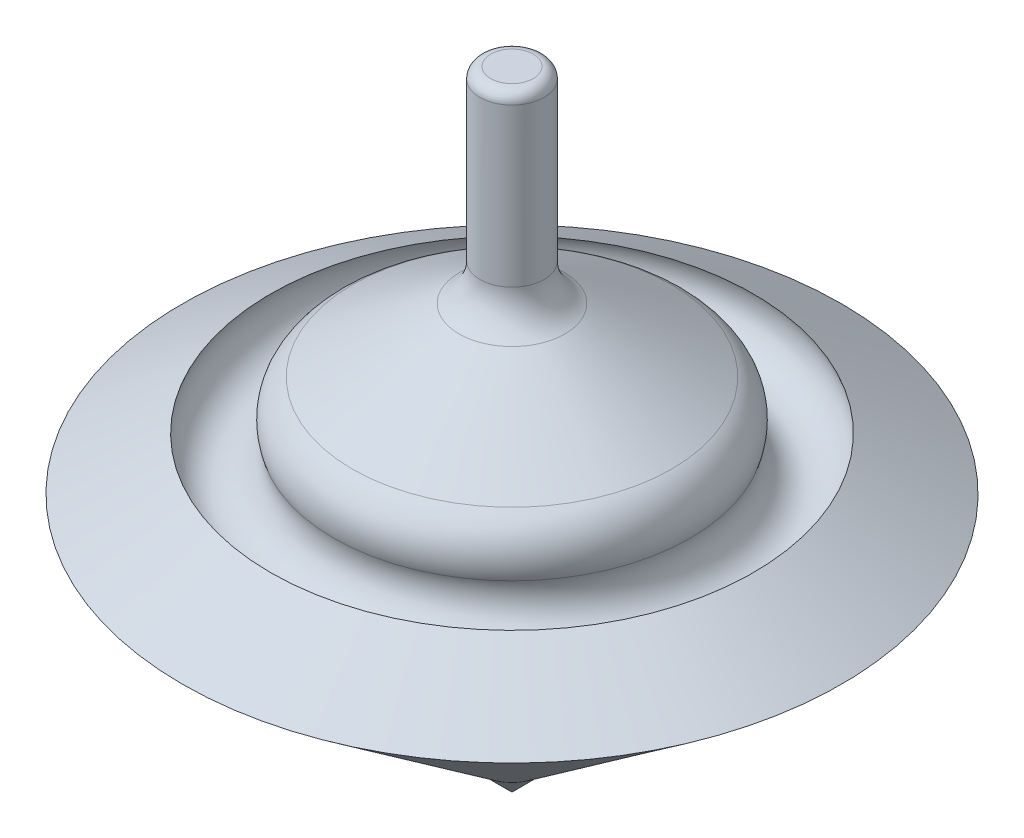
ISO-10303-21;
HEADER;
FILE_DESCRIPTION(('STEP AP214'),'2;1');
FILE_NAME('part.step','',(''),(''),'','','');
FILE_SCHEMA(('AUTOMOTIVE_DESIGN { 1 0 10303 214 1 1 1 1 }'));
ENDSEC;
DATA;
#1=APPLICATION_CONTEXT('core data for automotive mechanical design processes');
#2=APPLICATION_PROTOCOL_DEFINITION('international standard','automotive_design',2000,#1);
#3=PRODUCT_CONTEXT('',#1,'mechanical');
#4=PRODUCT('Part','Part','',(#3));
#5=PRODUCT_RELATED_PRODUCT_CATEGORY('part','',(#4));
#6=PRODUCT_DEFINITION_FORMATION('','',#4);
#7=PRODUCT_DEFINITION_CONTEXT('part definition',#1,'design');
#8=PRODUCT_DEFINITION('design','',#6,#7);
#9=PRODUCT_DEFINITION_SHAPE('','',#8);
#10=(LENGTH_UNIT() NAMED_UNIT(*) SI_UNIT(.MILLI.,.METRE.));
#11=(NAMED_UNIT(*) PLANE_ANGLE_UNIT() SI_UNIT($,.RADIAN.));
#12=(NAMED_UNIT(*) SI_UNIT($,.STERADIAN.) SOLID_ANGLE_UNIT());
#13=UNCERTAINTY_MEASURE_WITH_UNIT(LENGTH_MEASURE(1.E-05),#10,'distance_accuracy_value','');
#14=(GEOMETRIC_REPRESENTATION_CONTEXT(3) GLOBAL_UNCERTAINTY_ASSIGNED_CONTEXT((#13)) GLOBAL_UNIT_ASSIGNED_CONTEXT((#10,
#11,#12)) REPRESENTATION_CONTEXT('',''));
#15=CARTESIAN_POINT('',(0.,0.,0.));
#16=DIRECTION('',(0.,0.,1.));
#17=DIRECTION('',(1.,0.,0.));
#18=AXIS2_PLACEMENT_3D('',#15,#16,#17);
#19=CARTESIAN_POINT('',(0.,-33.3718770924988,0.28991346787051));
#20=DIRECTION('',(0.,-1.,0.));
#21=DIRECTION('',(0.,0.,-1.));
#22=AXIS2_PLACEMENT_3D('',#19,#20,#21);
#23=PLANE('',#22);
#24=CARTESIAN_POINT('',(0.,-33.3718770924988,0.));
#25=DIRECTION('',(0.,-1.,0.));
#26=DIRECTION('',(0.,0.,-1.));
#27=AXIS2_PLACEMENT_3D('',#24,#25,#26);
#28=CIRCLE('',#27,6.56409415873888);
#29=CARTESIAN_POINT('',(0.,-33.3718770924988,-6.56409415873888));
#30=VERTEX_POINT('',#29);
#31=EDGE_CURVE('E55',#30,#30,#28,.T.);
#32=ORIENTED_EDGE('',*,*,#31,.F.);
#33=EDGE_LOOP('',(#32));
#34=FACE_BOUND('',#33,.T.);
#35=CARTESIAN_POINT('',(0.,-33.3718770924988,0.));
#36=DIRECTION('',(0.,-1.,0.));
#37=DIRECTION('',(0.,0.,-1.));
#38=AXIS2_PLACEMENT_3D('',#35,#36,#37);
#39=CIRCLE('',#38,0.28991346787051);
#40=CARTESIAN_POINT('',(0.,-33.3718770924988,-0.28991346787051));
#41=VERTEX_POINT('',#40);
#42=EDGE_CURVE('E11',#41,#41,#39,.T.);
#43=ORIENTED_EDGE('',*,*,#42,.T.);
#44=EDGE_LOOP('',(#43));
#45=FACE_BOUND('',#44,.T.);
#46=ADVANCED_FACE('F45',(#34,#45),#23,.F.);
#47=CARTESIAN_POINT('',(0.,-49.303627638969,0.));
#48=DIRECTION('',(0.,-1.,0.));
#49=DIRECTION('',(0.,0.,-1.));
#50=AXIS2_PLACEMENT_3D('',#47,#48,#49);
#51=CYLINDRICAL_SURFACE('',#50,0.28991346787051);
#52=ORIENTED_EDGE('',*,*,#42,.F.);
#53=EDGE_LOOP('',(#52));
#54=FACE_BOUND('',#53,.T.);
#55=CARTESIAN_POINT('',(0.,-39.646057783367,0.));
#56=DIRECTION('',(0.,-1.,0.));
#57=DIRECTION('',(0.,0.,-1.));
#58=AXIS2_PLACEMENT_3D('',#55,#56,#57);
#59=CIRCLE('',#58,0.28991346787051);
#60=CARTESIAN_POINT('',(0.,-39.646057783367,-0.28991346787051));
#61=VERTEX_POINT('',#60);
#62=EDGE_CURVE('E51',#61,#61,#59,.T.);
#63=ORIENTED_EDGE('',*,*,#62,.T.);
#64=EDGE_LOOP('',(#63));
#65=FACE_BOUND('',#64,.T.);
#66=ADVANCED_FACE('F65',(#54,#65),#51,.F.);
#67=CARTESIAN_POINT('',(0.,-33.3718770924988,0.));
#68=DIRECTION('',(0.,1.,0.));
#69=DIRECTION('',(0.,0.,1.));
#70=AXIS2_PLACEMENT_3D('',#67,#68,#69);
#71=CONICAL_SURFACE('',#70,6.56409415873888,0.78539816339746);
#72=ORIENTED_EDGE('',*,*,#62,.F.);
#73=EDGE_LOOP('',(#72));
#74=FACE_BOUND('',#73,.T.);
#75=ORIENTED_EDGE('',*,*,#31,.T.);
#76=EDGE_LOOP('',(#75));
#77=FACE_BOUND('',#76,.T.);
#78=ADVANCED_FACE('F62',(#74,#77),#71,.T.);
#79=CLOSED_SHELL('',(#46,#66,#78));
#80=MANIFOLD_SOLID_BREP('B2',#79);
#81=CARTESIAN_POINT('',(0.,89.7878977820637,0.));
#82=DIRECTION('',(0.,1.,0.));
#83=DIRECTION('',(0.,0.,1.));
#84=AXIS2_PLACEMENT_3D('',#81,#82,#83);
#85=CYLINDRICAL_SURFACE('',#84,6.56409415873888);
#86=CARTESIAN_POINT('',(0.,-33.3718770924988,0.));
#87=DIRECTION('',(0.,1.,0.));
#88=DIRECTION('',(0.,0.,1.));
#89=AXIS2_PLACEMENT_3D('',#86,#87,#88);
#90=CIRCLE('',#89,6.56409415873888);
#91=CARTESIAN_POINT('',(0.,-33.3718770924988,6.56409415873888));
#92=VERTEX_POINT('',#91);
#93=EDGE_CURVE('E133',#92,#92,#90,.T.);
#94=ORIENTED_EDGE('',*,*,#93,.F.);
#95=EDGE_LOOP('',(#94));
#96=FACE_BOUND('',#95,.T.);
#97=CARTESIAN_POINT('',(0.,0.,0.));
#98=DIRECTION('',(0.,1.,0.));
#99=DIRECTION('',(0.,0.,1.));
#100=AXIS2_PLACEMENT_3D('',#97,#98,#99);
#101=CIRCLE('',#100,6.56409415873888);
#102=CARTESIAN_POINT('',(0.,0.,6.56409415873888));
#103=VERTEX_POINT('',#102);
#104=EDGE_CURVE('E129',#103,#103,#101,.T.);
#105=ORIENTED_EDGE('',*,*,#104,.T.);
#106=EDGE_LOOP('',(#105));
#107=FACE_BOUND('',#106,.T.);
#108=ADVANCED_FACE('F92',(#96,#107),#85,.F.);
#109=CARTESIAN_POINT('',(0.,62.4882243092578,0.));
#110=DIRECTION('',(0.,-1.,0.));
#111=DIRECTION('',(0.,0.,-1.));
#112=AXIS2_PLACEMENT_3D('',#109,#110,#111);
#113=CONICAL_SURFACE('',#112,6.56409415873888,1.03275211896927);
#114=CARTESIAN_POINT('',(0.,32.7269958950795,0.));
#115=DIRECTION('',(0.,1.,0.));
#116=DIRECTION('',(0.,0.,1.));
#117=AXIS2_PLACEMENT_3D('',#114,#115,#116);
#118=CIRCLE('',#117,56.4342606906052);
#119=CARTESIAN_POINT('',(0.,32.7269958950795,56.4342606906052));
#120=VERTEX_POINT('',#119);
#121=EDGE_CURVE('E125',#120,#120,#118,.T.);
#122=ORIENTED_EDGE('',*,*,#121,.F.);
#123=EDGE_LOOP('',(#122));
#124=FACE_BOUND('',#123,.T.);
#125=CARTESIAN_POINT('',(0.,20.4310256705424,0.));
#126=DIRECTION('',(0.,1.,0.));
#127=DIRECTION('',(0.,0.,1.));
#128=AXIS2_PLACEMENT_3D('',#125,#126,#127);
#129=CIRCLE('',#128,77.0383189046943);
#130=CARTESIAN_POINT('',(0.,20.4310256705424,77.0383189046943));
#131=VERTEX_POINT('',#130);
#132=EDGE_CURVE('E124',#131,#131,#129,.T.);
#133=ORIENTED_EDGE('',*,*,#132,.T.);
#134=EDGE_LOOP('',(#133));
#135=FACE_BOUND('',#134,.T.);
#136=ADVANCED_FACE('F146',(#124,#135),#113,.T.);
#137=CARTESIAN_POINT('',(0.,20.4310256705424,0.));
#138=DIRECTION('',(0.,1.,0.));
#139=DIRECTION('',(0.,0.,1.));
#140=AXIS2_PLACEMENT_3D('',#137,#138,#139);
#141=CONICAL_SURFACE('',#140,77.0383189046943,0.918748417569001);
#142=ORIENTED_EDGE('',*,*,#93,.T.);
#143=EDGE_LOOP('',(#142));
#144=FACE_BOUND('',#143,.T.);
#145=ORIENTED_EDGE('',*,*,#132,.F.);
#146=EDGE_LOOP('',(#145));
#147=FACE_BOUND('',#146,.T.);
#148=ADVANCED_FACE('F141',(#144,#147),#141,.T.);
#149=CARTESIAN_POINT('',(0.,0.,0.));
#150=DIRECTION('',(0.,1.,0.));
#151=DIRECTION('',(0.,0.,1.));
#152=AXIS2_PLACEMENT_3D('',#149,#150,#151);
#153=PLANE('',#152);
#154=ORIENTED_EDGE('',*,*,#104,.F.);
#155=EDGE_LOOP('',(#154));
#156=FACE_BOUND('',#155,.T.);
#157=ADVANCED_FACE('F150',(#156),#153,.F.);
#158=CARTESIAN_POINT('',(0.,29.7379903579667,0.));
#159=DIRECTION('',(0.,1.,0.));
#160=DIRECTION('',(0.,0.,1.));
#161=AXIS2_PLACEMENT_3D('',#158,#159,#160);
#162=TOROIDAL_SURFACE('',#161,49.1280742227899,7.8939543198182);
#163=CARTESIAN_POINT('',(0.,32.2988473696393,0.));
#164=DIRECTION('',(0.,-1.,0.));
#165=DIRECTION('',(0.,0.,-1.));
#166=AXIS2_PLACEMENT_3D('',#163,#164,#165);
#167=CIRCLE('',#166,41.6610449494347);
#168=CARTESIAN_POINT('',(0.,32.2988473696393,-41.6610449494347));
#169=VERTEX_POINT('',#168);
#170=EDGE_CURVE('E105',#169,#169,#167,.T.);
#171=ORIENTED_EDGE('',*,*,#170,.T.);
#172=EDGE_LOOP('',(#171));
#173=FACE_BOUND('',#172,.T.);
#174=ORIENTED_EDGE('',*,*,#121,.T.);
#175=EDGE_LOOP('',(#174));
#176=FACE_BOUND('',#175,.T.);
#177=ADVANCED_FACE('F152',(#173,#176),#162,.F.);
#178=CARTESIAN_POINT('',(0.,107.,0.));
#179=DIRECTION('',(0.,1.,0.));
#180=DIRECTION('',(0.,0.,1.));
#181=AXIS2_PLACEMENT_3D('',#178,#179,#180);
#182=PLANE('',#181);
#183=CARTESIAN_POINT('',(0.,107.,0.));
#184=DIRECTION('',(0.,1.,0.));
#185=DIRECTION('',(0.,0.,1.));
#186=AXIS2_PLACEMENT_3D('',#183,#184,#185);
#187=CIRCLE('',#186,4.96);
#188=CARTESIAN_POINT('',(0.,107.,4.96));
#189=VERTEX_POINT('',#188);
#190=EDGE_CURVE('E100',#189,#189,#187,.T.);
#191=ORIENTED_EDGE('',*,*,#190,.T.);
#192=EDGE_LOOP('',(#191));
#193=FACE_BOUND('',#192,.T.);
#194=ADVANCED_FACE('F158',(#193),#182,.T.);
#195=CARTESIAN_POINT('',(0.,107.,0.));
#196=DIRECTION('',(0.,-1.,0.));
#197=DIRECTION('',(0.,0.,-1.));
#198=AXIS2_PLACEMENT_3D('',#195,#196,#197);
#199=CYLINDRICAL_SURFACE('',#198,7.5);
#200=CARTESIAN_POINT('',(0.,104.46,0.));
#201=DIRECTION('',(0.,1.,0.));
#202=DIRECTION('',(0.,0.,1.));
#203=AXIS2_PLACEMENT_3D('',#200,#201,#202);
#204=CIRCLE('',#203,7.5);
#205=CARTESIAN_POINT('',(0.,104.46,7.5));
#206=VERTEX_POINT('',#205);
#207=EDGE_CURVE('E44',#206,#206,#204,.F.);
#208=ORIENTED_EDGE('',*,*,#207,.T.);
#209=EDGE_LOOP('',(#208));
#210=FACE_BOUND('',#209,.T.);
#211=CARTESIAN_POINT('',(0.,67.6072979241082,0.));
#212=DIRECTION('',(0.,-1.,0.));
#213=DIRECTION('',(0.,0.,-1.));
#214=AXIS2_PLACEMENT_3D('',#211,#212,#213);
#215=CIRCLE('',#214,7.5);
#216=CARTESIAN_POINT('',(0.,67.6072979241082,-7.5));
#217=VERTEX_POINT('',#216);
#218=EDGE_CURVE('E110',#217,#217,#215,.F.);
#219=ORIENTED_EDGE('',*,*,#218,.T.);
#220=EDGE_LOOP('',(#219));
#221=FACE_BOUND('',#220,.T.);
#222=ADVANCED_FACE('F164',(#210,#221),#199,.T.);
#223=CARTESIAN_POINT('',(0.,59.020172089591,0.));
#224=DIRECTION('',(0.,1.,0.));
#225=DIRECTION('',(0.,0.,1.));
#226=AXIS2_PLACEMENT_3D('',#223,#224,#225);
#227=CIRCLE('',#226,12.3754249052075);
#228=CARTESIAN_POINT('',(0.,59.020172089591,12.3754249052075));
#229=VERTEX_POINT('',#228);
#230=EDGE_CURVE('E116',#229,#229,#227,.F.);
#231=ORIENTED_EDGE('',*,*,#230,.T.);
#232=EDGE_LOOP('',(#231));
#233=FACE_BOUND('',#232,.T.);
#234=CARTESIAN_POINT('',(0.,44.130046969878,0.));
#235=DIRECTION('',(0.,-1.,0.));
#236=DIRECTION('',(0.,0.,-1.));
#237=AXIS2_PLACEMENT_3D('',#234,#235,#236);
#238=CIRCLE('',#237,37.3264453760779);
#239=CARTESIAN_POINT('',(0.,44.130046969878,-37.3264453760779));
#240=VERTEX_POINT('',#239);
#241=EDGE_CURVE('E120',#240,#240,#238,.F.);
#242=ORIENTED_EDGE('',*,*,#241,.T.);
#243=EDGE_LOOP('',(#242));
#244=FACE_BOUND('',#243,.T.);
#245=ADVANCED_FACE('F166',(#233,#244),#113,.T.);
#246=CARTESIAN_POINT('',(0.,67.6072979241082,0.));
#247=DIRECTION('',(0.,-1.,0.));
#248=DIRECTION('',(0.,0.,-1.));
#249=AXIS2_PLACEMENT_3D('',#246,#247,#248);
#250=TOROIDAL_SURFACE('',#249,17.5,10.);
#251=ORIENTED_EDGE('',*,*,#218,.F.);
#252=EDGE_LOOP('',(#251));
#253=FACE_BOUND('',#252,.T.);
#254=ORIENTED_EDGE('',*,*,#230,.F.);
#255=EDGE_LOOP('',(#254));
#256=FACE_BOUND('',#255,.T.);
#257=ADVANCED_FACE('F171',(#253,#256),#250,.F.);
#258=CARTESIAN_POINT('',(0.,35.5429211353608,0.));
#259=DIRECTION('',(0.,1.,0.));
#260=DIRECTION('',(0.,0.,1.));
#261=AXIS2_PLACEMENT_3D('',#258,#259,#260);
#262=TOROIDAL_SURFACE('',#261,32.2018702812854,10.);
#263=ORIENTED_EDGE('',*,*,#241,.F.);
#264=EDGE_LOOP('',(#263));
#265=FACE_BOUND('',#264,.T.);
#266=ORIENTED_EDGE('',*,*,#170,.F.);
#267=EDGE_LOOP('',(#266));
#268=FACE_BOUND('',#267,.T.);
#269=ADVANCED_FACE('F173',(#265,#268),#262,.T.);
#270=CARTESIAN_POINT('',(0.,104.46,0.));
#271=DIRECTION('',(0.,1.,0.));
#272=DIRECTION('',(0.,0.,1.));
#273=AXIS2_PLACEMENT_3D('',#270,#271,#272);
#274=TOROIDAL_SURFACE('',#273,4.96,2.54);
#275=ORIENTED_EDGE('',*,*,#207,.F.);
#276=EDGE_LOOP('',(#275));
#277=FACE_BOUND('',#276,.T.);
#278=ORIENTED_EDGE('',*,*,#190,.F.);
#279=EDGE_LOOP('',(#278));
#280=FACE_BOUND('',#279,.T.);
#281=ADVANCED_FACE('F94',(#277,#280),#274,.T.);
#282=CLOSED_SHELL('',(#108,#136,#148,#157,#177,#194,#222,#245,#257,#269,#281));
#283=MANIFOLD_SOLID_BREP('B6',#282);
#284=ADVANCED_BREP_SHAPE_REPRESENTATION('',(#18,#80,#283),#14);
#285=SHAPE_DEFINITION_REPRESENTATION(#9,#284);
ENDSEC;
END-ISO-10303-21;
